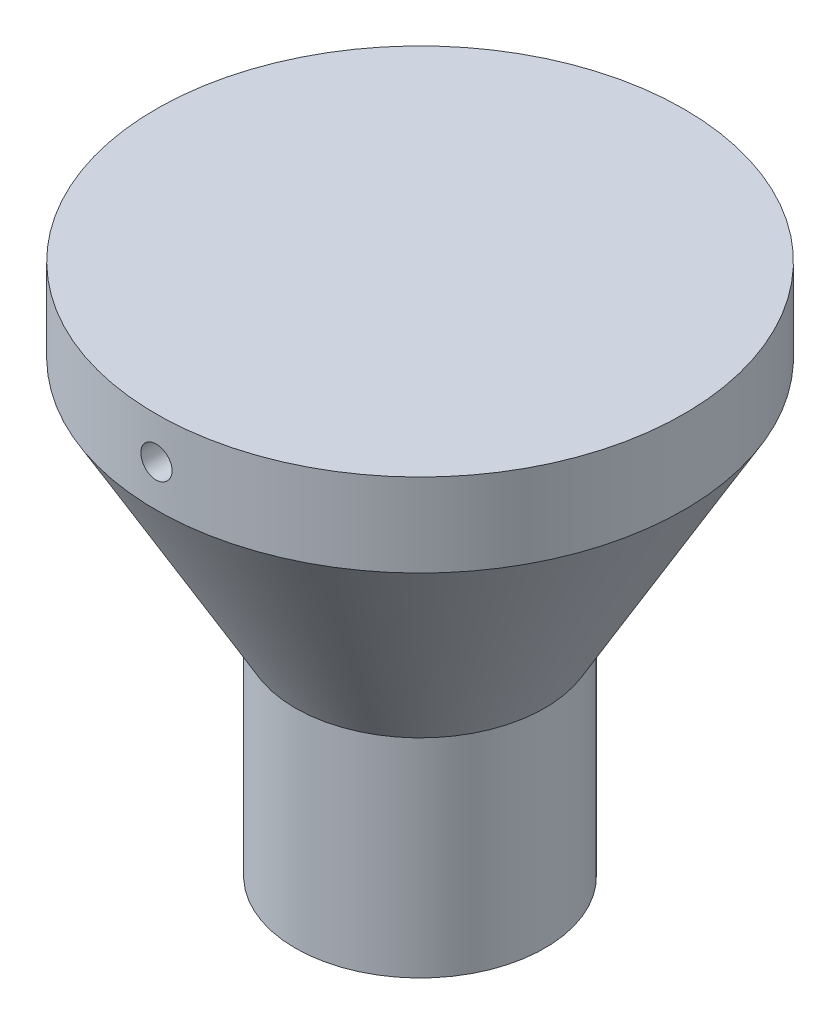
ISO-10303-21;
HEADER;
FILE_DESCRIPTION(('STEP AP214'),'2;1');
FILE_NAME('part.step','',(''),(''),'','','');
FILE_SCHEMA(('AUTOMOTIVE_DESIGN { 1 0 10303 214 1 1 1 1 }'));
ENDSEC;
DATA;
#1=APPLICATION_CONTEXT('core data for automotive mechanical design processes');
#2=APPLICATION_PROTOCOL_DEFINITION('international standard','automotive_design',2000,#1);
#3=PRODUCT_CONTEXT('',#1,'mechanical');
#4=PRODUCT('Part','Part','',(#3));
#5=PRODUCT_RELATED_PRODUCT_CATEGORY('part','',(#4));
#6=PRODUCT_DEFINITION_FORMATION('','',#4);
#7=PRODUCT_DEFINITION_CONTEXT('part definition',#1,'design');
#8=PRODUCT_DEFINITION('design','',#6,#7);
#9=PRODUCT_DEFINITION_SHAPE('','',#8);
#10=(LENGTH_UNIT() NAMED_UNIT(*) SI_UNIT(.MILLI.,.METRE.));
#11=(NAMED_UNIT(*) PLANE_ANGLE_UNIT() SI_UNIT($,.RADIAN.));
#12=(NAMED_UNIT(*) SI_UNIT($,.STERADIAN.) SOLID_ANGLE_UNIT());
#13=UNCERTAINTY_MEASURE_WITH_UNIT(LENGTH_MEASURE(1.E-05),#10,'distance_accuracy_value','');
#14=(GEOMETRIC_REPRESENTATION_CONTEXT(3) GLOBAL_UNCERTAINTY_ASSIGNED_CONTEXT((#13)) GLOBAL_UNIT_ASSIGNED_CONTEXT((#10,
#11,#12)) REPRESENTATION_CONTEXT('',''));
#15=CARTESIAN_POINT('',(0.,0.,0.));
#16=DIRECTION('',(0.,0.,1.));
#17=DIRECTION('',(1.,0.,0.));
#18=AXIS2_PLACEMENT_3D('',#15,#16,#17);
#19=CARTESIAN_POINT('',(-63.4863156129984,120.5,0.));
#20=DIRECTION('',(0.,-1.,0.));
#21=DIRECTION('',(0.,0.,-1.));
#22=AXIS2_PLACEMENT_3D('',#19,#20,#21);
#23=PLANE('',#22);
#24=DIRECTION('',(0.,0.,1.));
#25=VECTOR('',#24,1.);
#26=CARTESIAN_POINT('',(2.79508497187474,120.5,-75.));
#27=LINE('',#26,#25);
#28=CARTESIAN_POINT('',(2.79508497187474,120.5,-55.9165005693156));
#29=VERTEX_POINT('',#28);
#30=CARTESIAN_POINT('',(2.79508497187474,120.5,55.9165005693156));
#31=VERTEX_POINT('',#30);
#32=EDGE_CURVE('E71',#29,#31,#27,.T.);
#33=ORIENTED_EDGE('',*,*,#32,.F.);
#34=CARTESIAN_POINT('',(0.,120.5,0.));
#35=DIRECTION('',(0.,-1.,0.));
#36=DIRECTION('',(0.,0.,-1.));
#37=AXIS2_PLACEMENT_3D('',#34,#35,#36);
#38=CIRCLE('',#37,55.9863156129984);
#39=EDGE_CURVE('E86',#29,#31,#38,.T.);
#40=ORIENTED_EDGE('',*,*,#39,.T.);
#41=EDGE_LOOP('',(#33,#40));
#42=FACE_BOUND('',#41,.T.);
#43=ADVANCED_FACE('F45',(#42),#23,.T.);
#44=CARTESIAN_POINT('',(0.,0.,0.));
#45=DIRECTION('',(0.,1.,0.));
#46=DIRECTION('',(0.,0.,1.));
#47=AXIS2_PLACEMENT_3D('',#44,#45,#46);
#48=PLANE('',#47);
#49=CARTESIAN_POINT('',(0.,0.,0.));
#50=DIRECTION('',(0.,-1.,0.));
#51=DIRECTION('',(0.,0.,-1.));
#52=AXIS2_PLACEMENT_3D('',#49,#50,#51);
#53=CIRCLE('',#52,28.25);
#54=CARTESIAN_POINT('',(0.,0.,-28.25));
#55=VERTEX_POINT('',#54);
#56=EDGE_CURVE('E198',#55,#55,#53,.T.);
#57=ORIENTED_EDGE('',*,*,#56,.F.);
#58=EDGE_LOOP('',(#57));
#59=FACE_BOUND('',#58,.T.);
#60=CARTESIAN_POINT('',(0.,0.,0.));
#61=DIRECTION('',(0.,-1.,0.));
#62=DIRECTION('',(0.,0.,-1.));
#63=AXIS2_PLACEMENT_3D('',#60,#61,#62);
#64=CIRCLE('',#63,30.);
#65=CARTESIAN_POINT('',(0.,0.,-30.));
#66=VERTEX_POINT('',#65);
#67=EDGE_CURVE('E83',#66,#66,#64,.T.);
#68=ORIENTED_EDGE('',*,*,#67,.T.);
#69=EDGE_LOOP('',(#68));
#70=FACE_BOUND('',#69,.T.);
#71=ADVANCED_FACE('F47',(#59,#70),#48,.F.);
#72=CARTESIAN_POINT('',(0.,0.,0.));
#73=DIRECTION('',(0.,-1.,0.));
#74=DIRECTION('',(0.,0.,-1.));
#75=AXIS2_PLACEMENT_3D('',#72,#73,#74);
#76=CYLINDRICAL_SURFACE('',#75,30.);
#77=ORIENTED_EDGE('',*,*,#67,.F.);
#78=EDGE_LOOP('',(#77));
#79=FACE_BOUND('',#78,.T.);
#80=CARTESIAN_POINT('',(0.,50.,0.));
#81=DIRECTION('',(0.,-1.,0.));
#82=DIRECTION('',(0.,0.,-1.));
#83=AXIS2_PLACEMENT_3D('',#80,#81,#82);
#84=CIRCLE('',#83,30.);
#85=CARTESIAN_POINT('',(0.,50.,-30.));
#86=VERTEX_POINT('',#85);
#87=EDGE_CURVE('E116',#86,#86,#84,.T.);
#88=ORIENTED_EDGE('',*,*,#87,.T.);
#89=EDGE_LOOP('',(#88));
#90=FACE_BOUND('',#89,.T.);
#91=ADVANCED_FACE('F163',(#79,#90),#76,.T.);
#92=CARTESIAN_POINT('',(0.,108.,0.));
#93=DIRECTION('',(0.,1.,0.));
#94=DIRECTION('',(0.,0.,1.));
#95=AXIS2_PLACEMENT_3D('',#92,#93,#94);
#96=CONICAL_SURFACE('',#95,63.4863156129984,0.5235987755983);
#97=ORIENTED_EDGE('',*,*,#87,.F.);
#98=EDGE_LOOP('',(#97));
#99=FACE_BOUND('',#98,.T.);
#100=CARTESIAN_POINT('',(0.,108.,0.));
#101=DIRECTION('',(0.,-1.,0.));
#102=DIRECTION('',(0.,0.,-1.));
#103=AXIS2_PLACEMENT_3D('',#100,#101,#102);
#104=CIRCLE('',#103,63.4863156129984);
#105=CARTESIAN_POINT('',(0.,108.,-63.4863156129984));
#106=VERTEX_POINT('',#105);
#107=EDGE_CURVE('E112',#106,#106,#104,.T.);
#108=ORIENTED_EDGE('',*,*,#107,.T.);
#109=EDGE_LOOP('',(#108));
#110=FACE_BOUND('',#109,.T.);
#111=ADVANCED_FACE('F159',(#99,#110),#96,.T.);
#112=CARTESIAN_POINT('',(0.,0.,0.));
#113=DIRECTION('',(0.,-1.,0.));
#114=DIRECTION('',(0.,0.,-1.));
#115=AXIS2_PLACEMENT_3D('',#112,#113,#114);
#116=CYLINDRICAL_SURFACE('',#115,63.4863156129984);
#117=CARTESIAN_POINT('',(0.,121.75,-63.4863156129984));
#118=CARTESIAN_POINT('',(-0.210442281941689,121.749990732019,-63.4863141378654));
#119=CARTESIAN_POINT('',(-0.421032474894307,121.732226101705,-63.4852580676457));
#120=CARTESIAN_POINT('',(-0.836399600606697,121.661613546697,-63.4811467224573));
#121=CARTESIAN_POINT('',(-1.04116945081616,121.608724639105,-63.4780891121574));
#122=CARTESIAN_POINT('',(-1.43881904437072,121.469386485748,-63.4703206357446));
#123=CARTESIAN_POINT('',(-1.6317049359773,121.38295476547,-63.4656106330987));
#124=CARTESIAN_POINT('',(-2.0001797463886,121.179012443587,-63.4550673279223));
#125=CARTESIAN_POINT('',(-2.17577264975608,121.061509024467,-63.4492342850769));
#126=CARTESIAN_POINT('',(-2.50496562670623,120.798583913714,-63.4370918883714));
#127=CARTESIAN_POINT('',(-2.6585392595022,120.653129140251,-63.4307819755351));
#128=CARTESIAN_POINT('',(-2.93910837813233,120.338497941677,-63.4184017878423));
#129=CARTESIAN_POINT('',(-3.06610276083926,120.169320532483,-63.4123315229405));
#130=CARTESIAN_POINT('',(-3.28998798255815,119.811899190569,-63.4011109466597));
#131=CARTESIAN_POINT('',(-3.3868571588315,119.623641665912,-63.3959612984132));
#132=CARTESIAN_POINT('',(-3.547603513568,119.233499419678,-63.387169818024));
#133=CARTESIAN_POINT('',(-3.61148101578282,119.031614831846,-63.3835279710852));
#134=CARTESIAN_POINT('',(-3.70435819430559,118.62020135467,-63.3781680457063));
#135=CARTESIAN_POINT('',(-3.73339887107761,118.410681751171,-63.3764477059536));
#136=CARTESIAN_POINT('',(-3.75590459055896,117.989735106034,-63.3751180208166));
#137=CARTESIAN_POINT('',(-3.74936999991212,117.778308084076,-63.3755086536763));
#138=CARTESIAN_POINT('',(-3.70094473421347,117.359827407764,-63.3783547621972));
#139=CARTESIAN_POINT('',(-3.65909840577675,117.152768601699,-63.3808076479425));
#140=CARTESIAN_POINT('',(-3.54130629538894,116.748619442879,-63.3874977468034));
#141=CARTESIAN_POINT('',(-3.46536032694834,116.551529144647,-63.3917349696774));
#142=CARTESIAN_POINT('',(-3.28147432965622,116.172769077946,-63.4015191983549));
#143=CARTESIAN_POINT('',(-3.17351415384934,115.991109112873,-63.407067028492));
#144=CARTESIAN_POINT('',(-2.92867895538414,115.64847356104,-63.4188464109625));
#145=CARTESIAN_POINT('',(-2.79180364353377,115.487498181181,-63.4250779701338));
#146=CARTESIAN_POINT('',(-2.49277364890662,115.190543256188,-63.437534028757));
#147=CARTESIAN_POINT('',(-2.33058058009322,115.054602361251,-63.4437585027896));
#148=CARTESIAN_POINT('',(-1.98565380505491,114.811873306649,-63.4554897266892));
#149=CARTESIAN_POINT('',(-1.80292009234348,114.705085156189,-63.4609964763296));
#150=CARTESIAN_POINT('',(-1.42207597243139,114.523696313722,-63.4706720734515));
#151=CARTESIAN_POINT('',(-1.22396488267807,114.449097051442,-63.4748408615029));
#152=CARTESIAN_POINT('',(-0.81799999420604,114.334229238213,-63.4813699353713));
#153=CARTESIAN_POINT('',(-0.610146297168904,114.293960329049,-63.4837302400587));
#154=CARTESIAN_POINT('',(-0.190931796335603,114.248944124545,-63.4863739359725));
#155=CARTESIAN_POINT('',(0.0204232496626468,114.244143384942,-63.4866604520186));
#156=CARTESIAN_POINT('',(0.440935708536588,114.27006020374,-63.485132590235));
#157=CARTESIAN_POINT('',(0.65009313160563,114.300777597321,-63.4833182221543));
#158=CARTESIAN_POINT('',(1.06012281367151,114.396814481888,-63.4777948867783));
#159=CARTESIAN_POINT('',(1.26100082719265,114.462109487503,-63.4740872602184));
#160=CARTESIAN_POINT('',(1.64894701214252,114.625423255984,-63.4651946190953));
#161=CARTESIAN_POINT('',(1.83601507253896,114.723442281918,-63.4600095926555));
#162=CARTESIAN_POINT('',(2.19127611154097,114.949557972415,-63.4487371757645));
#163=CARTESIAN_POINT('',(2.35944631235526,115.07769037017,-63.4426487164686));
#164=CARTESIAN_POINT('',(2.67190868029444,115.360343526198,-63.4302583496989));
#165=CARTESIAN_POINT('',(2.81620063668698,115.514864517331,-63.4239564403419));
#166=CARTESIAN_POINT('',(3.07699130910327,115.846138957955,-63.4118404361638));
#167=CARTESIAN_POINT('',(3.19345538067854,116.022919706254,-63.4060269551887));
#168=CARTESIAN_POINT('',(3.39504737831378,116.393558088602,-63.3955531292049));
#169=CARTESIAN_POINT('',(3.48017548083651,116.587415626478,-63.3908927777027));
#170=CARTESIAN_POINT('',(3.61661894932987,116.986577606191,-63.3832551753701));
#171=CARTESIAN_POINT('',(3.66795620355532,117.1918745444,-63.3802768351833));
#172=CARTESIAN_POINT('',(3.7354322152398,117.608192157259,-63.3763360907167));
#173=CARTESIAN_POINT('',(3.75157127757464,117.819212782315,-63.3753736689758));
#174=CARTESIAN_POINT('',(3.74818987701258,118.240643095936,-63.3755737163691));
#175=CARTESIAN_POINT('',(3.72872388912944,118.451053225299,-63.3767329394311));
#176=CARTESIAN_POINT('',(3.6547978009026,118.865612052145,-63.3810387669489));
#177=CARTESIAN_POINT('',(3.60033763608835,119.069760738092,-63.3841853750663));
#178=CARTESIAN_POINT('',(3.45798108601971,119.466010706091,-63.3921105846685));
#179=CARTESIAN_POINT('',(3.37008477627393,119.65811201535,-63.3968891824679));
#180=CARTESIAN_POINT('',(3.16335891334086,120.024837014254,-63.4075397389359));
#181=CARTESIAN_POINT('',(3.04453020516155,120.199461181159,-63.4134116677358));
#182=CARTESIAN_POINT('',(2.7791126039864,120.526550300637,-63.4255975714539));
#183=CARTESIAN_POINT('',(2.63248463551997,120.678983521248,-63.4319121606182));
#184=CARTESIAN_POINT('',(2.31567746967084,120.957122561858,-63.4442667391588));
#185=CARTESIAN_POINT('',(2.1454925096339,121.08282182289,-63.4503066608626));
#186=CARTESIAN_POINT('',(1.78622649609725,121.30400726226,-63.4614369490416));
#187=CARTESIAN_POINT('',(1.5971238672808,121.399458414125,-63.4665262119021));
#188=CARTESIAN_POINT('',(1.20568530912295,121.557139956851,-63.4751664723998));
#189=CARTESIAN_POINT('',(1.0033652327141,121.619409353389,-63.4787192752396));
#190=CARTESIAN_POINT('',(0.666501349603864,121.692731217863,-63.4829526903068));
#191=CARTESIAN_POINT('',(0.534136363353876,121.714179345862,-63.484208200264));
#192=CARTESIAN_POINT('',(0.267867563131021,121.742816678135,-63.4858901306249));
#193=CARTESIAN_POINT('',(0.133963751038343,121.750005899829,-63.4863165520414));
#194=CARTESIAN_POINT('',(0.,121.75,-63.4863156129984));
#195=B_SPLINE_CURVE_WITH_KNOTS('',3,(#117,#118,#119,#120,#121,#122,#123,#124,#125,#126,#127,
#128,#129,#130,#131,#132,#133,#134,#135,#136,#137,#138,#139,#140,#141,#142,#143,#144,#145,#146,
#147,#148,#149,#150,#151,#152,#153,#154,#155,#156,#157,#158,#159,#160,#161,#162,#163,#164,#165,
#166,#167,#168,#169,#170,#171,#172,#173,#174,#175,#176,#177,#178,#179,#180,#181,#182,#183,#184,
#185,#186,#187,#188,#189,#190,#191,#192,#193,#194),.UNSPECIFIED.,.T.,.F.,(4,2,2,2,2,2,2,2,2,2,2,
2,2,2,2,2,2,2,2,2,2,2,2,2,2,2,2,2,2,2,2,2,2,2,2,2,2,2,4),(0.,0.630837807424083,1.26241297068328,
1.89365859113978,2.52475842120095,3.15660984191369,3.78848748136262,4.42081845271941,
5.05314321881058,5.68472305121208,6.31629637447347,6.94707770818916,7.57786249166389,
8.2090450816658,8.84023398468099,9.47238934327626,10.1045449015002,10.7367285351536,
11.3689055723054,12.0001298357558,12.6313511700715,13.2621261155189,13.8929061318572,
14.5244384589761,15.1559763592518,15.7882964459899,16.4206129718785,17.0525195062416,
17.6844205672048,18.3153556407803,18.9462918767449,19.5772266878791,20.2081442650111,
20.8399553435293,21.4719212535556,22.1046163109437,22.7365659753934,23.1381464061185,
23.5397263462312),.UNSPECIFIED.);
#196=CARTESIAN_POINT('',(0.,121.75,-63.4863156129984));
#197=VERTEX_POINT('',#196);
#198=EDGE_CURVE('E147',#197,#197,#195,.T.);
#199=ORIENTED_EDGE('',*,*,#198,.T.);
#200=EDGE_LOOP('',(#199));
#201=FACE_BOUND('',#200,.T.);
#202=CARTESIAN_POINT('',(3.75,118.,63.3754666263945));
#203=CARTESIAN_POINT('',(3.74999073169196,117.789558079196,63.37546811116));
#204=CARTESIAN_POINT('',(3.73222616028633,117.578968246162,63.3765260735763));
#205=CARTESIAN_POINT('',(3.66161386055362,117.163601868307,63.380644179278));
#206=CARTESIAN_POINT('',(3.60872514810262,116.958832406317,63.3837066614497));
#207=CARTESIAN_POINT('',(3.46938756567158,116.561183633422,63.391485710293));
#208=CARTESIAN_POINT('',(3.38295623048408,116.368298170967,63.3962014126004));
#209=CARTESIAN_POINT('',(3.17901481527595,115.999824078701,63.4067544538803));
#210=CARTESIAN_POINT('',(3.06151191678662,115.824231464871,63.4125915335851));
#211=CARTESIAN_POINT('',(2.79858733037579,115.495038157221,63.4247386069056));
#212=CARTESIAN_POINT('',(2.65313244446504,115.341463996794,63.4310491573651));
#213=CARTESIAN_POINT('',(2.33850079996523,115.060893860906,63.4434269126607));
#214=CARTESIAN_POINT('',(2.16932305872795,114.933898986955,63.4494941074032));
#215=CARTESIAN_POINT('',(1.81190142962319,114.710013254472,63.4607061602387));
#216=CARTESIAN_POINT('',(1.62364400688514,114.61314396764,63.4658503563));
#217=CARTESIAN_POINT('',(1.23350198226464,114.452397380331,63.4746309617538));
#218=CARTESIAN_POINT('',(1.03161751357626,114.388519757439,63.4782673858811));
#219=CARTESIAN_POINT('',(0.620204385995658,114.295642322403,63.4836188830982));
#220=CARTESIAN_POINT('',(0.410685014943791,114.266601500725,63.4853362151606));
#221=CARTESIAN_POINT('',(-0.0102611761909366,114.244095410911,63.4866636163088));
#222=CARTESIAN_POINT('',(-0.221687976675587,114.250629777666,63.4862737070213));
#223=CARTESIAN_POINT('',(-0.640169648927775,114.299054692073,63.4834324512589));
#224=CARTESIAN_POINT('',(-0.847229646111928,114.340901118397,63.4809836772858));
#225=CARTESIAN_POINT('',(-1.25138113674083,114.458693838683,63.4743033856823));
#226=CARTESIAN_POINT('',(-1.44847257630115,114.534640316949,63.4700718584165));
#227=CARTESIAN_POINT('',(-1.82723401414409,114.718527363275,63.4602981357385));
#228=CARTESIAN_POINT('',(-2.00889426743083,114.826487958252,63.454755120345));
#229=CARTESIAN_POINT('',(-2.35153021729201,115.071324047836,63.4429823645625));
#230=CARTESIAN_POINT('',(-2.51250570678201,115.20819983189,63.4367526172994));
#231=CARTESIAN_POINT('',(-2.80946008652534,115.507230157551,63.4242964117921));
#232=CARTESIAN_POINT('',(-2.94540042225901,115.669422989794,63.4180699731045));
#233=CARTESIAN_POINT('',(-3.18812846189285,116.014349093695,63.4063318741899));
#234=CARTESIAN_POINT('',(-3.29491615545993,116.197082372633,63.4008202142163));
#235=CARTESIAN_POINT('',(-3.47630467067981,116.577926383395,63.3911339823366));
#236=CARTESIAN_POINT('',(-3.55090392006477,116.776037865821,63.3869594757473));
#237=CARTESIAN_POINT('',(-3.66577158680693,117.182003606554,63.3804206941813));
#238=CARTESIAN_POINT('',(-3.70604036471094,117.389857762519,63.3780564001933));
#239=CARTESIAN_POINT('',(-3.75105607544595,117.809072463493,63.3754082195288));
#240=CARTESIAN_POINT('',(-3.7558565771455,118.020427237276,63.3751211954986));
#241=CARTESIAN_POINT('',(-3.72993937973952,118.440939094273,63.3766517286598));
#242=CARTESIAN_POINT('',(-3.69922184543395,118.650096187679,63.3784692760862));
#243=CARTESIAN_POINT('',(-3.6031850121488,119.060124297429,63.3840012527571));
#244=CARTESIAN_POINT('',(-3.53789033935175,119.26100110147,63.3877143319174));
#245=CARTESIAN_POINT('',(-3.37457764240901,119.648945015067,63.3966177715035));
#246=CARTESIAN_POINT('',(-3.27655935324912,119.836012012769,63.4018081438932));
#247=CARTESIAN_POINT('',(-3.05044473546487,120.191272348322,63.4130888501756));
#248=CARTESIAN_POINT('',(-2.92231248621786,120.359442789045,63.4191802555999));
#249=CARTESIAN_POINT('',(-2.63965949117248,120.671905710387,63.4315727898972));
#250=CARTESIAN_POINT('',(-2.48513851364433,120.816197981302,63.4378739206115));
#251=CARTESIAN_POINT('',(-2.15386393152005,121.076989304029,63.4499849811714));
#252=CARTESIAN_POINT('',(-1.9770830265273,121.193453709644,63.4557942929461));
#253=CARTESIAN_POINT('',(-1.60644424450148,121.395046293983,63.46625821475));
#254=CARTESIAN_POINT('',(-1.41258646365636,121.480174649199,63.4709128312825));
#255=CARTESIAN_POINT('',(-1.01342466115635,121.616618291393,63.4785399069438));
#256=CARTESIAN_POINT('',(-0.808128180572665,121.667955575953,63.4815134602462));
#257=CARTESIAN_POINT('',(-0.391811530480476,121.735431803474,63.4854476955797));
#258=CARTESIAN_POINT('',(-0.180791410169964,121.751571048886,63.486408394907));
#259=CARTESIAN_POINT('',(0.240639241269756,121.748190169867,63.4862087269987));
#260=CARTESIAN_POINT('',(0.451050211350038,121.728724302109,63.4850515870204));
#261=CARTESIAN_POINT('',(0.865610748879075,121.654798157788,63.4807528028654));
#262=CARTESIAN_POINT('',(1.06976030506094,121.60033781826,63.4776111551179));
#263=CARTESIAN_POINT('',(1.46601197286708,121.457980604317,63.46969657296));
#264=CARTESIAN_POINT('',(1.6581141111624,121.370083803929,63.4649236421611));
#265=CARTESIAN_POINT('',(2.02484056250384,121.163356704085,63.4542826480818));
#266=CARTESIAN_POINT('',(2.19946535331808,121.044527250537,63.4484146147501));
#267=CARTESIAN_POINT('',(2.52655440309092,120.779108843508,63.4362330693292));
#268=CARTESIAN_POINT('',(2.67898706740874,120.632480984023,63.42991894076));
#269=CARTESIAN_POINT('',(2.95712503669897,120.315674263057,63.4175616051121));
#270=CARTESIAN_POINT('',(3.08282378126905,120.145489637711,63.4115184648194));
#271=CARTESIAN_POINT('',(3.30400868069948,119.786223882643,63.4003794456976));
#272=CARTESIAN_POINT('',(3.39945971206844,119.597121117932,63.3952846709164));
#273=CARTESIAN_POINT('',(3.55714099157105,119.205682268775,63.3866335482403));
#274=CARTESIAN_POINT('',(3.61941024722937,119.003362038041,63.3830753948756));
#275=CARTESIAN_POINT('',(3.69273170442786,118.666498533505,63.3788352657992));
#276=CARTESIAN_POINT('',(3.71417964939296,118.534134108944,63.3775776490348));
#277=CARTESIAN_POINT('',(3.74281673842851,118.267866434708,63.3758928572565));
#278=CARTESIAN_POINT('',(3.75000590002257,118.133963186924,63.375465681222));
#279=CARTESIAN_POINT('',(3.75,118.,63.3754666263945));
#280=B_SPLINE_CURVE_WITH_KNOTS('',3,(#202,#203,#204,#205,#206,#207,#208,#209,#210,#211,#212,
#213,#214,#215,#216,#217,#218,#219,#220,#221,#222,#223,#224,#225,#226,#227,#228,#229,#230,#231,
#232,#233,#234,#235,#236,#237,#238,#239,#240,#241,#242,#243,#244,#245,#246,#247,#248,#249,#250,
#251,#252,#253,#254,#255,#256,#257,#258,#259,#260,#261,#262,#263,#264,#265,#266,#267,#268,#269,
#270,#271,#272,#273,#274,#275,#276,#277,#278,#279),.UNSPECIFIED.,.T.,.F.,(4,2,2,2,2,2,2,2,2,2,2,
2,2,2,2,2,2,2,2,2,2,2,2,2,2,2,2,2,2,2,2,2,2,2,2,2,2,2,4),(0.,0.630836722813325,1.26241082516357,
1.89365520865105,2.52475382074987,3.15660666037933,3.78848568035493,4.42081612672625,
5.05314039344122,5.68471956159872,6.31629224786163,6.94707697001459,7.57786510147104,
8.20904866743288,8.8402385519641,9.47239249527418,10.1045466626498,10.7367317045585,
11.3689101070269,12.0001335147419,12.6313539936581,13.2621255144922,13.8929021437918,
14.5244350312467,15.1559734647251,15.7882941251756,16.4206112242168,17.052516284245,
17.6844159144039,18.3153534295757,18.9462920800006,19.57722933358,20.2081493348801,
20.8399589645566,21.471923459479,22.1046191219619,22.7365693558627,23.1381480971745,
23.5397263449581),.UNSPECIFIED.);
#281=CARTESIAN_POINT('',(3.75,118.,63.3754666263945));
#282=VERTEX_POINT('',#281);
#283=EDGE_CURVE('E88',#282,#282,#280,.T.);
#284=ORIENTED_EDGE('',*,*,#283,.T.);
#285=EDGE_LOOP('',(#284));
#286=FACE_BOUND('',#285,.T.);
#287=ORIENTED_EDGE('',*,*,#107,.F.);
#288=EDGE_LOOP('',(#287));
#289=FACE_BOUND('',#288,.T.);
#290=CARTESIAN_POINT('',(0.,128.,0.));
#291=DIRECTION('',(0.,-1.,0.));
#292=DIRECTION('',(0.,0.,-1.));
#293=AXIS2_PLACEMENT_3D('',#290,#291,#292);
#294=CIRCLE('',#293,63.4863156129984);
#295=CARTESIAN_POINT('',(0.,128.,-63.4863156129984));
#296=VERTEX_POINT('',#295);
#297=EDGE_CURVE('E108',#296,#296,#294,.T.);
#298=ORIENTED_EDGE('',*,*,#297,.T.);
#299=EDGE_LOOP('',(#298));
#300=FACE_BOUND('',#299,.T.);
#301=ADVANCED_FACE('F153',(#201,#286,#289,#300),#116,.T.);
#302=CARTESIAN_POINT('',(-63.4863156129984,128.,0.));
#303=DIRECTION('',(0.,-1.,0.));
#304=DIRECTION('',(0.,0.,-1.));
#305=AXIS2_PLACEMENT_3D('',#302,#303,#304);
#306=PLANE('',#305);
#307=ORIENTED_EDGE('',*,*,#297,.F.);
#308=EDGE_LOOP('',(#307));
#309=FACE_BOUND('',#308,.T.);
#310=ADVANCED_FACE('F158',(#309),#306,.F.);
#311=CARTESIAN_POINT('',(0.,2.,0.));
#312=DIRECTION('',(0.,-1.,0.));
#313=DIRECTION('',(0.,0.,-1.));
#314=AXIS2_PLACEMENT_3D('',#311,#312,#313);
#315=CYLINDRICAL_SURFACE('',#314,28.25);
#316=CARTESIAN_POINT('',(0.,2.,0.));
#317=DIRECTION('',(0.,-1.,0.));
#318=DIRECTION('',(0.,0.,-1.));
#319=AXIS2_PLACEMENT_3D('',#316,#317,#318);
#320=CIRCLE('',#319,28.25);
#321=CARTESIAN_POINT('',(0.,2.,-28.25));
#322=VERTEX_POINT('',#321);
#323=EDGE_CURVE('E101',#322,#322,#320,.T.);
#324=ORIENTED_EDGE('',*,*,#323,.F.);
#325=EDGE_LOOP('',(#324));
#326=FACE_BOUND('',#325,.T.);
#327=ORIENTED_EDGE('',*,*,#56,.T.);
#328=EDGE_LOOP('',(#327));
#329=FACE_BOUND('',#328,.T.);
#330=ADVANCED_FACE('F222',(#326,#329),#315,.F.);
#331=CARTESIAN_POINT('',(0.,2.,0.));
#332=DIRECTION('',(0.,-1.,0.));
#333=DIRECTION('',(0.,0.,-1.));
#334=AXIS2_PLACEMENT_3D('',#331,#332,#333);
#335=PLANE('',#334);
#336=CARTESIAN_POINT('',(0.,2.,0.));
#337=DIRECTION('',(0.,-1.,0.));
#338=DIRECTION('',(0.,0.,-1.));
#339=AXIS2_PLACEMENT_3D('',#336,#337,#338);
#340=CIRCLE('',#339,24.);
#341=CARTESIAN_POINT('',(0.,2.,-24.));
#342=VERTEX_POINT('',#341);
#343=EDGE_CURVE('E194',#342,#342,#340,.T.);
#344=ORIENTED_EDGE('',*,*,#343,.F.);
#345=EDGE_LOOP('',(#344));
#346=FACE_BOUND('',#345,.T.);
#347=ORIENTED_EDGE('',*,*,#323,.T.);
#348=EDGE_LOOP('',(#347));
#349=FACE_BOUND('',#348,.T.);
#350=ADVANCED_FACE('F185',(#346,#349),#335,.T.);
#351=CARTESIAN_POINT('',(0.,2.,0.));
#352=DIRECTION('',(0.,-1.,0.));
#353=DIRECTION('',(0.,0.,-1.));
#354=AXIS2_PLACEMENT_3D('',#351,#352,#353);
#355=CYLINDRICAL_SURFACE('',#354,24.);
#356=ORIENTED_EDGE('',*,*,#343,.T.);
#357=EDGE_LOOP('',(#356));
#358=FACE_BOUND('',#357,.T.);
#359=CARTESIAN_POINT('',(0.,0.,0.));
#360=DIRECTION('',(0.,-1.,0.));
#361=DIRECTION('',(0.,0.,-1.));
#362=AXIS2_PLACEMENT_3D('',#359,#360,#361);
#363=CIRCLE('',#362,24.);
#364=CARTESIAN_POINT('',(0.,0.,-24.));
#365=VERTEX_POINT('',#364);
#366=EDGE_CURVE('E191',#365,#365,#363,.T.);
#367=ORIENTED_EDGE('',*,*,#366,.F.);
#368=EDGE_LOOP('',(#367));
#369=FACE_BOUND('',#368,.T.);
#370=ADVANCED_FACE('F134',(#358,#369),#355,.T.);
#371=DIRECTION('',(0.,0.,1.));
#372=VECTOR('',#371,1.);
#373=CARTESIAN_POINT('',(-2.79508497187474,120.5,-75.));
#374=LINE('',#373,#372);
#375=CARTESIAN_POINT('',(-2.79508497187474,120.5,55.9165005693156));
#376=VERTEX_POINT('',#375);
#377=CARTESIAN_POINT('',(-2.79508497187474,120.5,-55.9165005693156));
#378=VERTEX_POINT('',#377);
#379=EDGE_CURVE('E66',#376,#378,#374,.F.);
#380=ORIENTED_EDGE('',*,*,#379,.F.);
#381=EDGE_CURVE('E94',#376,#378,#38,.T.);
#382=ORIENTED_EDGE('',*,*,#381,.T.);
#383=EDGE_LOOP('',(#380,#382));
#384=FACE_BOUND('',#383,.T.);
#385=ADVANCED_FACE('F174',(#384),#23,.T.);
#386=CARTESIAN_POINT('',(0.,0.,0.));
#387=DIRECTION('',(0.,-1.,0.));
#388=DIRECTION('',(0.,0.,-1.));
#389=AXIS2_PLACEMENT_3D('',#386,#387,#388);
#390=CYLINDRICAL_SURFACE('',#389,55.9863156129984);
#391=CARTESIAN_POINT('',(2.79508497187474,120.5,55.9165005693156));
#392=CARTESIAN_POINT('',(2.86535823265919,120.421446969551,55.9129875025113));
#393=CARTESIAN_POINT('',(2.93230242658556,120.339920909834,55.9095086632151));
#394=CARTESIAN_POINT('',(3.05909602318806,120.171525046564,55.9027146770963));
#395=CARTESIAN_POINT('',(3.11894569927905,120.084655449141,55.8993995239684));
#396=CARTESIAN_POINT('',(3.23108430267535,119.90622402526,55.8930298379774));
#397=CARTESIAN_POINT('',(3.28337789616922,119.814665142356,55.8899751447517));
#398=CARTESIAN_POINT('',(3.38007099896912,119.627492439948,55.8842105713529));
#399=CARTESIAN_POINT('',(3.42447062320276,119.531878679504,55.88150068616));
#400=CARTESIAN_POINT('',(3.5453648246189,119.239834327896,55.8740059514196));
#401=CARTESIAN_POINT('',(3.60959630838264,119.038134387071,55.8698535702134));
#402=CARTESIAN_POINT('',(3.70323741865284,118.626937038681,55.863725118322));
#403=CARTESIAN_POINT('',(3.73265517690665,118.417441463807,55.8617485394231));
#404=CARTESIAN_POINT('',(3.75589900381798,117.996752278266,55.8601906665124));
#405=CARTESIAN_POINT('',(3.74977650558683,117.785561562881,55.8606059110973));
#406=CARTESIAN_POINT('',(3.70221419886333,117.367187267118,55.8637780801313));
#407=CARTESIAN_POINT('',(3.6607688511997,117.160004320431,55.8665353718494));
#408=CARTESIAN_POINT('',(3.54378370375849,116.755667850186,55.8740775054346));
#409=CARTESIAN_POINT('',(3.46826354142132,116.558508622639,55.8788611793931));
#410=CARTESIAN_POINT('',(3.28529302313305,116.17967076162,55.8899162921155));
#411=CARTESIAN_POINT('',(3.17784434497603,115.997991315355,55.8961876527002));
#412=CARTESIAN_POINT('',(2.93383799516667,115.654901702531,55.9095254504922));
#413=CARTESIAN_POINT('',(2.79722841325484,115.493528508942,55.9165932948119));
#414=CARTESIAN_POINT('',(2.49887158737746,115.195979538011,55.9307198981432));
#415=CARTESIAN_POINT('',(2.33712358845282,115.059804517691,55.9377786568755));
#416=CARTESIAN_POINT('',(1.99282732431326,114.816346597369,55.9511022414669));
#417=CARTESIAN_POINT('',(1.81025226313728,114.709101528833,55.9573660221292));
#418=CARTESIAN_POINT('',(1.42964321792853,114.52679636728,55.9683826729707));
#419=CARTESIAN_POINT('',(1.2316094581066,114.451735807567,55.9731355650584));
#420=CARTESIAN_POINT('',(0.825949776619479,114.336021125313,55.980589669048));
#421=CARTESIAN_POINT('',(0.618335543913052,114.295326186321,55.983293314472));
#422=CARTESIAN_POINT('',(0.199205447285263,114.249365186416,55.9863533331883));
#423=CARTESIAN_POINT('',(-0.012310375728128,114.244098754249,55.9867097310774));
#424=CARTESIAN_POINT('',(-0.432828417036854,114.269122793012,55.9850366840149));
#425=CARTESIAN_POINT('',(-0.641834522931178,114.299348293172,55.9830115985457));
#426=CARTESIAN_POINT('',(-1.05179694897221,114.394379576845,55.9768104632725));
#427=CARTESIAN_POINT('',(-1.2527532612527,114.459185394149,55.9726344113668));
#428=CARTESIAN_POINT('',(-1.64100727793123,114.621555256126,55.962598172702));
#429=CARTESIAN_POINT('',(-1.82829975870534,114.719131749833,55.9567373460472));
#430=CARTESIAN_POINT('',(-2.18386620748911,114.944266301192,55.9439894967791));
#431=CARTESIAN_POINT('',(-2.35213983271782,115.07182489909,55.9371024556753));
#432=CARTESIAN_POINT('',(-2.66524778284531,115.353605907672,55.9230600933572));
#433=CARTESIAN_POINT('',(-2.81003452858658,115.507881165533,55.9159042628568));
#434=CARTESIAN_POINT('',(-3.07166579945278,115.838560921306,55.9021432293037));
#435=CARTESIAN_POINT('',(-3.18851053302639,116.01496525412,55.8955380221436));
#436=CARTESIAN_POINT('',(-3.39099274174604,116.38501576428,55.8836205020607));
#437=CARTESIAN_POINT('',(-3.47661442776141,116.578670603588,55.8783088437201));
#438=CARTESIAN_POINT('',(-3.61411549603739,116.97765406042,55.8695846170112));
#439=CARTESIAN_POINT('',(-3.66599477645674,117.182982713174,55.8661720543746));
#440=CARTESIAN_POINT('',(-3.7344537634011,117.59908397736,55.8616378455056));
#441=CARTESIAN_POINT('',(-3.75109722854181,117.809846056143,55.8605120615354));
#442=CARTESIAN_POINT('',(-3.74879052404128,118.231186835839,55.8606668947359));
#443=CARTESIAN_POINT('',(-3.72983914946745,118.441765530303,55.8619475933693));
#444=CARTESIAN_POINT('',(-3.65694039526429,118.856497912274,55.8667668522406));
#445=CARTESIAN_POINT('',(-3.60302996678351,119.060658145367,55.870303028411));
#446=CARTESIAN_POINT('',(-3.46177559284625,119.45698409646,55.8792323894967));
#447=CARTESIAN_POINT('',(-3.37444853625757,119.649155816524,55.88462463621));
#448=CARTESIAN_POINT('',(-3.20473847780978,119.952176521296,55.8945583890448));
#449=CARTESIAN_POINT('',(-3.13118569667797,120.068076416544,55.8987442245595));
#450=CARTESIAN_POINT('',(-2.97198855228788,120.290967522962,55.9074336363482));
#451=CARTESIAN_POINT('',(-2.88636298341258,120.397972177879,55.9119367134035));
#452=CARTESIAN_POINT('',(-2.79508497187474,120.5,55.9165005693156));
#453=B_SPLINE_CURVE_WITH_KNOTS('',3,(#391,#392,#393,#394,#395,#396,#397,#398,#399,#400,#401,
#402,#403,#404,#405,#406,#407,#408,#409,#410,#411,#412,#413,#414,#415,#416,#417,#418,#419,#420,
#421,#422,#423,#424,#425,#426,#427,#428,#429,#430,#431,#432,#433,#434,#435,#436,#437,#438,#439,
#440,#441,#442,#443,#444,#445,#446,#447,#448,#449,#450,#451,#452),.UNSPECIFIED.,.F.,.F.,(4,2,2,
2,2,2,2,2,2,2,2,2,2,2,2,2,2,2,2,2,2,2,2,2,2,2,2,2,2,2,4),(0.,0.316269751520473,
0.632527310388954,0.948588724915175,1.26464553755391,1.8965272840825,2.52826140729703,
3.1590815263204,3.79000058593898,4.42055650809251,5.05107930136634,5.68273401077994,
6.3144076937689,6.94690345045607,7.57939003521563,8.21112434743459,8.8428520397129,
9.47342510529763,10.1039987870594,10.7348122847315,11.3656371498798,11.9977243832185,
12.6298069010101,13.2622086137507,13.8946122351958,14.5258705514039,15.1571502369294,
15.7877637553622,16.4180589798095,16.8292927902418,17.2398933370371),.UNSPECIFIED.);
#454=EDGE_CURVE('E11',#31,#376,#453,.T.);
#455=ORIENTED_EDGE('',*,*,#454,.F.);
#456=ORIENTED_EDGE('',*,*,#39,.F.);
#457=CARTESIAN_POINT('',(-2.79508497187474,120.5,-55.9165005693156));
#458=CARTESIAN_POINT('',(-2.86535823265919,120.421446969551,-55.9129875025113));
#459=CARTESIAN_POINT('',(-2.93230242658556,120.339920909834,-55.9095086632151));
#460=CARTESIAN_POINT('',(-3.05909602318806,120.171525046564,-55.9027146770963));
#461=CARTESIAN_POINT('',(-3.11894569927905,120.084655449141,-55.8993995239684));
#462=CARTESIAN_POINT('',(-3.23108430267535,119.90622402526,-55.8930298379774));
#463=CARTESIAN_POINT('',(-3.28337789616922,119.814665142356,-55.8899751447517));
#464=CARTESIAN_POINT('',(-3.38007099896912,119.627492439948,-55.8842105713529));
#465=CARTESIAN_POINT('',(-3.42447062320276,119.531878679504,-55.88150068616));
#466=CARTESIAN_POINT('',(-3.5453648246189,119.239834327896,-55.8740059514196));
#467=CARTESIAN_POINT('',(-3.60959630838264,119.038134387071,-55.8698535702134));
#468=CARTESIAN_POINT('',(-3.70323741865284,118.626937038681,-55.863725118322));
#469=CARTESIAN_POINT('',(-3.73265517690665,118.417441463807,-55.8617485394231));
#470=CARTESIAN_POINT('',(-3.75589900381798,117.996752278266,-55.8601906665124));
#471=CARTESIAN_POINT('',(-3.74977650558683,117.785561562881,-55.8606059110973));
#472=CARTESIAN_POINT('',(-3.70221419886333,117.367187267118,-55.8637780801313));
#473=CARTESIAN_POINT('',(-3.6607688511997,117.160004320431,-55.8665353718494));
#474=CARTESIAN_POINT('',(-3.54378370375849,116.755667850186,-55.8740775054346));
#475=CARTESIAN_POINT('',(-3.46826354142132,116.558508622639,-55.8788611793931));
#476=CARTESIAN_POINT('',(-3.28529302313305,116.17967076162,-55.8899162921155));
#477=CARTESIAN_POINT('',(-3.17784434497603,115.997991315355,-55.8961876527002));
#478=CARTESIAN_POINT('',(-2.93383799516667,115.654901702531,-55.9095254504922));
#479=CARTESIAN_POINT('',(-2.79722841325484,115.493528508942,-55.9165932948119));
#480=CARTESIAN_POINT('',(-2.49887158737746,115.195979538011,-55.9307198981432));
#481=CARTESIAN_POINT('',(-2.33712358845282,115.059804517691,-55.9377786568755));
#482=CARTESIAN_POINT('',(-1.99282732431326,114.816346597369,-55.9511022414669));
#483=CARTESIAN_POINT('',(-1.81025226313728,114.709101528833,-55.9573660221292));
#484=CARTESIAN_POINT('',(-1.42964321792853,114.52679636728,-55.9683826729707));
#485=CARTESIAN_POINT('',(-1.2316094581066,114.451735807567,-55.9731355650584));
#486=CARTESIAN_POINT('',(-0.825949776619479,114.336021125313,-55.980589669048));
#487=CARTESIAN_POINT('',(-0.618335543913052,114.295326186321,-55.983293314472));
#488=CARTESIAN_POINT('',(-0.199205447285263,114.249365186416,-55.9863533331883));
#489=CARTESIAN_POINT('',(0.012310375728128,114.244098754249,-55.9867097310774));
#490=CARTESIAN_POINT('',(0.432828417036854,114.269122793012,-55.9850366840149));
#491=CARTESIAN_POINT('',(0.641834522931178,114.299348293172,-55.9830115985457));
#492=CARTESIAN_POINT('',(1.05179694897221,114.394379576845,-55.9768104632725));
#493=CARTESIAN_POINT('',(1.2527532612527,114.459185394149,-55.9726344113668));
#494=CARTESIAN_POINT('',(1.64100727793123,114.621555256126,-55.962598172702));
#495=CARTESIAN_POINT('',(1.82829975870534,114.719131749833,-55.9567373460472));
#496=CARTESIAN_POINT('',(2.18386620748911,114.944266301192,-55.9439894967791));
#497=CARTESIAN_POINT('',(2.35213983271782,115.07182489909,-55.9371024556753));
#498=CARTESIAN_POINT('',(2.66524778284531,115.353605907672,-55.9230600933572));
#499=CARTESIAN_POINT('',(2.81003452858658,115.507881165533,-55.9159042628568));
#500=CARTESIAN_POINT('',(3.07166579945278,115.838560921306,-55.9021432293037));
#501=CARTESIAN_POINT('',(3.18851053302639,116.01496525412,-55.8955380221436));
#502=CARTESIAN_POINT('',(3.39099274174604,116.38501576428,-55.8836205020607));
#503=CARTESIAN_POINT('',(3.47661442776141,116.578670603588,-55.8783088437201));
#504=CARTESIAN_POINT('',(3.61411549603739,116.97765406042,-55.8695846170112));
#505=CARTESIAN_POINT('',(3.66599477645674,117.182982713174,-55.8661720543746));
#506=CARTESIAN_POINT('',(3.7344537634011,117.59908397736,-55.8616378455056));
#507=CARTESIAN_POINT('',(3.75109722854181,117.809846056143,-55.8605120615354));
#508=CARTESIAN_POINT('',(3.74879052404128,118.231186835839,-55.8606668947359));
#509=CARTESIAN_POINT('',(3.72983914946745,118.441765530303,-55.8619475933693));
#510=CARTESIAN_POINT('',(3.65694039526429,118.856497912274,-55.8667668522406));
#511=CARTESIAN_POINT('',(3.60302996678351,119.060658145367,-55.870303028411));
#512=CARTESIAN_POINT('',(3.46177559284625,119.45698409646,-55.8792323894967));
#513=CARTESIAN_POINT('',(3.37444853625757,119.649155816524,-55.88462463621));
#514=CARTESIAN_POINT('',(3.20473847780978,119.952176521296,-55.8945583890448));
#515=CARTESIAN_POINT('',(3.13118569667797,120.068076416544,-55.8987442245595));
#516=CARTESIAN_POINT('',(2.97198855228788,120.290967522962,-55.9074336363482));
#517=CARTESIAN_POINT('',(2.88636298341258,120.397972177879,-55.9119367134035));
#518=CARTESIAN_POINT('',(2.79508497187474,120.5,-55.9165005693156));
#519=B_SPLINE_CURVE_WITH_KNOTS('',3,(#457,#458,#459,#460,#461,#462,#463,#464,#465,#466,#467,
#468,#469,#470,#471,#472,#473,#474,#475,#476,#477,#478,#479,#480,#481,#482,#483,#484,#485,#486,
#487,#488,#489,#490,#491,#492,#493,#494,#495,#496,#497,#498,#499,#500,#501,#502,#503,#504,#505,
#506,#507,#508,#509,#510,#511,#512,#513,#514,#515,#516,#517,#518),.UNSPECIFIED.,.F.,.F.,(4,2,2,
2,2,2,2,2,2,2,2,2,2,2,2,2,2,2,2,2,2,2,2,2,2,2,2,2,2,2,4),(0.,0.316269751520473,
0.632527310388954,0.948588724915175,1.26464553755391,1.8965272840825,2.52826140729703,
3.1590815263204,3.79000058593898,4.42055650809251,5.05107930136634,5.68273401077994,
6.3144076937689,6.94690345045607,7.57939003521563,8.21112434743459,8.8428520397129,
9.47342510529763,10.1039987870594,10.7348122847315,11.3656371498798,11.9977243832185,
12.6298069010101,13.2622086137507,13.8946122351958,14.5258705514039,15.1571502369294,
15.7877637553622,16.4180589798095,16.8292927902418,17.2398933370371),.UNSPECIFIED.);
#520=EDGE_CURVE('E60',#378,#29,#519,.T.);
#521=ORIENTED_EDGE('',*,*,#520,.F.);
#522=ORIENTED_EDGE('',*,*,#381,.F.);
#523=EDGE_LOOP('',(#455,#456,#521,#522));
#524=FACE_BOUND('',#523,.T.);
#525=CARTESIAN_POINT('',(0.,110.009618943233,0.));
#526=DIRECTION('',(0.,1.,0.));
#527=DIRECTION('',(0.,0.,1.));
#528=AXIS2_PLACEMENT_3D('',#525,#526,#527);
#529=CIRCLE('',#528,55.9863156129984);
#530=CARTESIAN_POINT('',(0.,110.009618943233,55.9863156129984));
#531=VERTEX_POINT('',#530);
#532=EDGE_CURVE('E93',#531,#531,#529,.F.);
#533=ORIENTED_EDGE('',*,*,#532,.T.);
#534=EDGE_LOOP('',(#533));
#535=FACE_BOUND('',#534,.T.);
#536=ADVANCED_FACE('F90',(#524,#535),#390,.F.);
#537=CARTESIAN_POINT('',(0.,111.75,0.));
#538=DIRECTION('',(0.,1.,0.));
#539=DIRECTION('',(0.,0.,1.));
#540=AXIS2_PLACEMENT_3D('',#537,#538,#539);
#541=CONICAL_SURFACE('',#540,56.9911250846151,0.5235987755983);
#542=CARTESIAN_POINT('',(0.,52.0096189432334,0.));
#543=DIRECTION('',(0.,1.,0.));
#544=DIRECTION('',(0.,0.,1.));
#545=AXIS2_PLACEMENT_3D('',#542,#543,#544);
#546=CIRCLE('',#545,22.5);
#547=CARTESIAN_POINT('',(0.,52.0096189432334,22.5));
#548=VERTEX_POINT('',#547);
#549=EDGE_CURVE('E99',#548,#548,#546,.F.);
#550=ORIENTED_EDGE('',*,*,#549,.T.);
#551=EDGE_LOOP('',(#550));
#552=FACE_BOUND('',#551,.T.);
#553=ORIENTED_EDGE('',*,*,#532,.F.);
#554=EDGE_LOOP('',(#553));
#555=FACE_BOUND('',#554,.T.);
#556=ADVANCED_FACE('F183',(#552,#555),#541,.F.);
#557=CARTESIAN_POINT('',(0.,0.,0.));
#558=DIRECTION('',(0.,-1.,0.));
#559=DIRECTION('',(0.,0.,-1.));
#560=AXIS2_PLACEMENT_3D('',#557,#558,#559);
#561=CYLINDRICAL_SURFACE('',#560,22.5);
#562=CARTESIAN_POINT('',(0.,0.,0.));
#563=DIRECTION('',(0.,1.,0.));
#564=DIRECTION('',(0.,0.,1.));
#565=AXIS2_PLACEMENT_3D('',#562,#563,#564);
#566=CIRCLE('',#565,22.5);
#567=CARTESIAN_POINT('',(0.,0.,22.5));
#568=VERTEX_POINT('',#567);
#569=EDGE_CURVE('E104',#568,#568,#566,.F.);
#570=ORIENTED_EDGE('',*,*,#569,.T.);
#571=EDGE_LOOP('',(#570));
#572=FACE_BOUND('',#571,.T.);
#573=ORIENTED_EDGE('',*,*,#549,.F.);
#574=EDGE_LOOP('',(#573));
#575=FACE_BOUND('',#574,.T.);
#576=ADVANCED_FACE('F212',(#572,#575),#561,.F.);
#577=ORIENTED_EDGE('',*,*,#569,.F.);
#578=EDGE_LOOP('',(#577));
#579=FACE_BOUND('',#578,.T.);
#580=ORIENTED_EDGE('',*,*,#366,.T.);
#581=EDGE_LOOP('',(#580));
#582=FACE_BOUND('',#581,.T.);
#583=ADVANCED_FACE('F132',(#579,#582),#48,.F.);
#584=CARTESIAN_POINT('',(0.,118.,-75.));
#585=DIRECTION('',(0.,0.,1.));
#586=DIRECTION('',(1.,0.,0.));
#587=AXIS2_PLACEMENT_3D('',#584,#585,#586);
#588=CYLINDRICAL_SURFACE('',#587,3.75);
#589=ORIENTED_EDGE('',*,*,#283,.F.);
#590=EDGE_LOOP('',(#589));
#591=FACE_BOUND('',#590,.T.);
#592=ORIENTED_EDGE('',*,*,#454,.T.);
#593=ORIENTED_EDGE('',*,*,#379,.T.);
#594=ORIENTED_EDGE('',*,*,#520,.T.);
#595=ORIENTED_EDGE('',*,*,#32,.T.);
#596=EDGE_LOOP('',(#592,#593,#594,#595));
#597=FACE_BOUND('',#596,.T.);
#598=ORIENTED_EDGE('',*,*,#198,.F.);
#599=EDGE_LOOP('',(#598));
#600=FACE_BOUND('',#599,.T.);
#601=ADVANCED_FACE('F76',(#591,#597,#600),#588,.F.);
#602=CLOSED_SHELL('',(#43,#71,#91,#111,#301,#310,#330,#350,#370,#385,#536,#556,#576,#583,#601));
#603=MANIFOLD_SOLID_BREP('B2',#602);
#604=ADVANCED_BREP_SHAPE_REPRESENTATION('',(#18,#603),#14);
#605=SHAPE_DEFINITION_REPRESENTATION(#9,#604);
ENDSEC;
END-ISO-10303-21;
